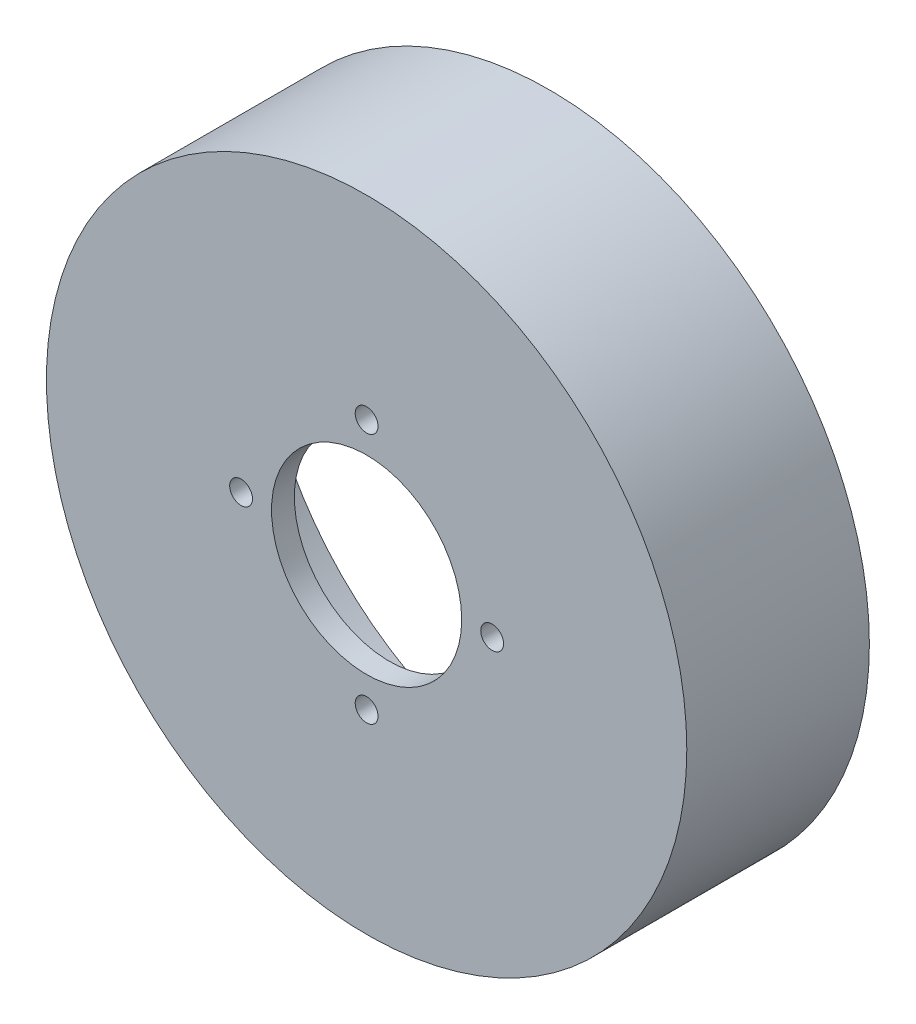
ISO-10303-21;
HEADER;
FILE_DESCRIPTION(('STEP AP214'),'2;1');
FILE_NAME('part.step','',(''),(''),'','','');
FILE_SCHEMA(('AUTOMOTIVE_DESIGN { 1 0 10303 214 1 1 1 1 }'));
ENDSEC;
DATA;
#1=APPLICATION_CONTEXT('core data for automotive mechanical design processes');
#2=APPLICATION_PROTOCOL_DEFINITION('international standard','automotive_design',2000,#1);
#3=PRODUCT_CONTEXT('',#1,'mechanical');
#4=PRODUCT('Part','Part','',(#3));
#5=PRODUCT_RELATED_PRODUCT_CATEGORY('part','',(#4));
#6=PRODUCT_DEFINITION_FORMATION('','',#4);
#7=PRODUCT_DEFINITION_CONTEXT('part definition',#1,'design');
#8=PRODUCT_DEFINITION('design','',#6,#7);
#9=PRODUCT_DEFINITION_SHAPE('','',#8);
#10=(LENGTH_UNIT() NAMED_UNIT(*) SI_UNIT(.MILLI.,.METRE.));
#11=(NAMED_UNIT(*) PLANE_ANGLE_UNIT() SI_UNIT($,.RADIAN.));
#12=(NAMED_UNIT(*) SI_UNIT($,.STERADIAN.) SOLID_ANGLE_UNIT());
#13=UNCERTAINTY_MEASURE_WITH_UNIT(LENGTH_MEASURE(1.E-05),#10,'distance_accuracy_value','');
#14=(GEOMETRIC_REPRESENTATION_CONTEXT(3) GLOBAL_UNCERTAINTY_ASSIGNED_CONTEXT((#13)) GLOBAL_UNIT_ASSIGNED_CONTEXT((#10,
#11,#12)) REPRESENTATION_CONTEXT('',''));
#15=CARTESIAN_POINT('',(0.,0.,0.));
#16=DIRECTION('',(0.,0.,1.));
#17=DIRECTION('',(1.,0.,0.));
#18=AXIS2_PLACEMENT_3D('',#15,#16,#17);
#19=CARTESIAN_POINT('',(0.,0.,16.));
#20=DIRECTION('',(0.,0.,-1.));
#21=DIRECTION('',(-1.,0.,0.));
#22=AXIS2_PLACEMENT_3D('',#19,#20,#21);
#23=CYLINDRICAL_SURFACE('',#22,42.0875);
#24=CARTESIAN_POINT('',(0.,0.,16.));
#25=DIRECTION('',(0.,0.,1.));
#26=DIRECTION('',(1.,0.,0.));
#27=AXIS2_PLACEMENT_3D('',#24,#25,#26);
#28=CIRCLE('',#27,42.0875);
#29=CARTESIAN_POINT('',(42.0875,0.,16.));
#30=VERTEX_POINT('',#29);
#31=EDGE_CURVE('E11',#30,#30,#28,.T.);
#32=ORIENTED_EDGE('',*,*,#31,.F.);
#33=EDGE_LOOP('',(#32));
#34=FACE_BOUND('',#33,.T.);
#35=CARTESIAN_POINT('',(0.,0.,-8.00000000000001));
#36=DIRECTION('',(0.,0.,1.));
#37=DIRECTION('',(1.,0.,0.));
#38=AXIS2_PLACEMENT_3D('',#35,#36,#37);
#39=CIRCLE('',#38,42.0875);
#40=CARTESIAN_POINT('',(42.0875,0.,-8.00000000000001));
#41=VERTEX_POINT('',#40);
#42=EDGE_CURVE('E40',#41,#41,#39,.T.);
#43=ORIENTED_EDGE('',*,*,#42,.T.);
#44=EDGE_LOOP('',(#43));
#45=FACE_BOUND('',#44,.T.);
#46=ADVANCED_FACE('F33',(#34,#45),#23,.T.);
#47=CARTESIAN_POINT('',(0.,0.,16.));
#48=DIRECTION('',(0.,0.,1.));
#49=DIRECTION('',(1.,0.,0.));
#50=AXIS2_PLACEMENT_3D('',#47,#48,#49);
#51=PLANE('',#50);
#52=CARTESIAN_POINT('',(-16.5,0.,16.));
#53=DIRECTION('',(0.,0.,-1.));
#54=DIRECTION('',(1.,0.,0.));
#55=AXIS2_PLACEMENT_3D('',#52,#53,#54);
#56=CIRCLE('',#55,1.5);
#57=CARTESIAN_POINT('',(-15.,0.,16.));
#58=VERTEX_POINT('',#57);
#59=EDGE_CURVE('E63',#58,#58,#56,.T.);
#60=ORIENTED_EDGE('',*,*,#59,.T.);
#61=EDGE_LOOP('',(#60));
#62=FACE_BOUND('',#61,.T.);
#63=CARTESIAN_POINT('',(1.72828326272735E-13,16.5,16.));
#64=DIRECTION('',(0.,0.,-1.));
#65=DIRECTION('',(0.,-1.,0.));
#66=AXIS2_PLACEMENT_3D('',#63,#64,#65);
#67=CIRCLE('',#66,1.5);
#68=CARTESIAN_POINT('',(1.57116660247941E-13,15.,16.));
#69=VERTEX_POINT('',#68);
#70=EDGE_CURVE('E68',#69,#69,#67,.T.);
#71=ORIENTED_EDGE('',*,*,#70,.T.);
#72=EDGE_LOOP('',(#71));
#73=FACE_BOUND('',#72,.T.);
#74=CARTESIAN_POINT('',(0.,-16.5,16.));
#75=DIRECTION('',(0.,0.,-1.));
#76=DIRECTION('',(0.,1.,0.));
#77=AXIS2_PLACEMENT_3D('',#74,#75,#76);
#78=CIRCLE('',#77,1.5);
#79=CARTESIAN_POINT('',(0.,-15.,16.));
#80=VERTEX_POINT('',#79);
#81=EDGE_CURVE('E60',#80,#80,#78,.T.);
#82=ORIENTED_EDGE('',*,*,#81,.T.);
#83=EDGE_LOOP('',(#82));
#84=FACE_BOUND('',#83,.T.);
#85=CARTESIAN_POINT('',(16.5,0.,16.));
#86=DIRECTION('',(0.,0.,-1.));
#87=DIRECTION('',(-1.,0.,0.));
#88=AXIS2_PLACEMENT_3D('',#85,#86,#87);
#89=CIRCLE('',#88,1.5);
#90=CARTESIAN_POINT('',(15.,0.,16.));
#91=VERTEX_POINT('',#90);
#92=EDGE_CURVE('E57',#91,#91,#89,.T.);
#93=ORIENTED_EDGE('',*,*,#92,.T.);
#94=EDGE_LOOP('',(#93));
#95=FACE_BOUND('',#94,.T.);
#96=CARTESIAN_POINT('',(0.,0.,16.));
#97=DIRECTION('',(0.,0.,1.));
#98=DIRECTION('',(1.,0.,0.));
#99=AXIS2_PLACEMENT_3D('',#96,#97,#98);
#100=CIRCLE('',#99,12.5);
#101=CARTESIAN_POINT('',(12.5,0.,16.));
#102=VERTEX_POINT('',#101);
#103=EDGE_CURVE('E53',#102,#102,#100,.T.);
#104=ORIENTED_EDGE('',*,*,#103,.F.);
#105=EDGE_LOOP('',(#104));
#106=FACE_BOUND('',#105,.T.);
#107=ORIENTED_EDGE('',*,*,#31,.T.);
#108=EDGE_LOOP('',(#107));
#109=FACE_BOUND('',#108,.T.);
#110=ADVANCED_FACE('F110',(#62,#73,#84,#95,#106,#109),#51,.T.);
#111=CARTESIAN_POINT('',(0.,0.,-8.00000000000001));
#112=DIRECTION('',(0.,0.,1.));
#113=DIRECTION('',(1.,0.,0.));
#114=AXIS2_PLACEMENT_3D('',#111,#112,#113);
#115=PLANE('',#114);
#116=CARTESIAN_POINT('',(0.,0.,-8.00000000000001));
#117=DIRECTION('',(0.,0.,-1.));
#118=DIRECTION('',(-1.,0.,0.));
#119=AXIS2_PLACEMENT_3D('',#116,#117,#118);
#120=CIRCLE('',#119,38.2875);
#121=CARTESIAN_POINT('',(-38.2875,0.,-8.00000000000001));
#122=VERTEX_POINT('',#121);
#123=EDGE_CURVE('E86',#122,#122,#120,.T.);
#124=ORIENTED_EDGE('',*,*,#123,.F.);
#125=EDGE_LOOP('',(#124));
#126=FACE_BOUND('',#125,.T.);
#127=ORIENTED_EDGE('',*,*,#42,.F.);
#128=EDGE_LOOP('',(#127));
#129=FACE_BOUND('',#128,.T.);
#130=ADVANCED_FACE('F106',(#126,#129),#115,.F.);
#131=CARTESIAN_POINT('',(0.,0.,2.99999999999999));
#132=DIRECTION('',(0.,0.,1.));
#133=DIRECTION('',(1.,0.,0.));
#134=AXIS2_PLACEMENT_3D('',#131,#132,#133);
#135=PLANE('',#134);
#136=CARTESIAN_POINT('',(0.,0.,2.99999999999999));
#137=DIRECTION('',(0.,0.,-1.));
#138=DIRECTION('',(-1.,0.,0.));
#139=AXIS2_PLACEMENT_3D('',#136,#137,#138);
#140=CIRCLE('',#139,34.2875);
#141=CARTESIAN_POINT('',(-34.2875,0.,2.99999999999999));
#142=VERTEX_POINT('',#141);
#143=EDGE_CURVE('E81',#142,#142,#140,.T.);
#144=ORIENTED_EDGE('',*,*,#143,.F.);
#145=EDGE_LOOP('',(#144));
#146=FACE_BOUND('',#145,.T.);
#147=CARTESIAN_POINT('',(0.,0.,2.99999999999999));
#148=DIRECTION('',(0.,0.,1.));
#149=DIRECTION('',(1.,0.,0.));
#150=AXIS2_PLACEMENT_3D('',#147,#148,#149);
#151=CIRCLE('',#150,38.2875);
#152=CARTESIAN_POINT('',(38.2875,0.,2.99999999999999));
#153=VERTEX_POINT('',#152);
#154=EDGE_CURVE('E45',#153,#153,#151,.F.);
#155=ORIENTED_EDGE('',*,*,#154,.T.);
#156=EDGE_LOOP('',(#155));
#157=FACE_BOUND('',#156,.T.);
#158=ADVANCED_FACE('F93',(#146,#157),#135,.F.);
#159=CARTESIAN_POINT('',(0.,0.,124.29340353872));
#160=DIRECTION('',(0.,0.,-1.));
#161=DIRECTION('',(-1.,0.,0.));
#162=AXIS2_PLACEMENT_3D('',#159,#160,#161);
#163=CYLINDRICAL_SURFACE('',#162,38.2875);
#164=ORIENTED_EDGE('',*,*,#123,.T.);
#165=EDGE_LOOP('',(#164));
#166=FACE_BOUND('',#165,.T.);
#167=ORIENTED_EDGE('',*,*,#154,.F.);
#168=EDGE_LOOP('',(#167));
#169=FACE_BOUND('',#168,.T.);
#170=ADVANCED_FACE('F95',(#166,#169),#163,.F.);
#171=CARTESIAN_POINT('',(0.,0.,13.));
#172=DIRECTION('',(0.,0.,1.));
#173=DIRECTION('',(1.,0.,0.));
#174=AXIS2_PLACEMENT_3D('',#171,#172,#173);
#175=PLANE('',#174);
#176=CARTESIAN_POINT('',(-16.5,0.,13.));
#177=DIRECTION('',(0.,0.,1.));
#178=DIRECTION('',(1.,0.,0.));
#179=AXIS2_PLACEMENT_3D('',#176,#177,#178);
#180=CIRCLE('',#179,1.5);
#181=CARTESIAN_POINT('',(-15.,0.,13.));
#182=VERTEX_POINT('',#181);
#183=EDGE_CURVE('E36',#182,#182,#180,.T.);
#184=ORIENTED_EDGE('',*,*,#183,.T.);
#185=EDGE_LOOP('',(#184));
#186=FACE_BOUND('',#185,.T.);
#187=CARTESIAN_POINT('',(1.72828326272735E-13,16.5,13.));
#188=DIRECTION('',(0.,0.,1.));
#189=DIRECTION('',(1.,0.,0.));
#190=AXIS2_PLACEMENT_3D('',#187,#188,#189);
#191=CIRCLE('',#190,1.5);
#192=CARTESIAN_POINT('',(1.50000000000017,16.5,13.));
#193=VERTEX_POINT('',#192);
#194=EDGE_CURVE('E61',#193,#193,#191,.T.);
#195=ORIENTED_EDGE('',*,*,#194,.T.);
#196=EDGE_LOOP('',(#195));
#197=FACE_BOUND('',#196,.T.);
#198=CARTESIAN_POINT('',(0.,-16.5,13.));
#199=DIRECTION('',(0.,0.,1.));
#200=DIRECTION('',(1.,0.,0.));
#201=AXIS2_PLACEMENT_3D('',#198,#199,#200);
#202=CIRCLE('',#201,1.5);
#203=CARTESIAN_POINT('',(1.49999999999994,-16.5,13.));
#204=VERTEX_POINT('',#203);
#205=EDGE_CURVE('E58',#204,#204,#202,.T.);
#206=ORIENTED_EDGE('',*,*,#205,.T.);
#207=EDGE_LOOP('',(#206));
#208=FACE_BOUND('',#207,.T.);
#209=CARTESIAN_POINT('',(16.5,0.,13.));
#210=DIRECTION('',(0.,0.,1.));
#211=DIRECTION('',(1.,0.,0.));
#212=AXIS2_PLACEMENT_3D('',#209,#210,#211);
#213=CIRCLE('',#212,1.5);
#214=CARTESIAN_POINT('',(18.,0.,13.));
#215=VERTEX_POINT('',#214);
#216=EDGE_CURVE('E54',#215,#215,#213,.T.);
#217=ORIENTED_EDGE('',*,*,#216,.T.);
#218=EDGE_LOOP('',(#217));
#219=FACE_BOUND('',#218,.T.);
#220=CARTESIAN_POINT('',(0.,0.,13.));
#221=DIRECTION('',(0.,0.,1.));
#222=DIRECTION('',(1.,0.,0.));
#223=AXIS2_PLACEMENT_3D('',#220,#221,#222);
#224=CIRCLE('',#223,12.5);
#225=CARTESIAN_POINT('',(12.5,0.,13.));
#226=VERTEX_POINT('',#225);
#227=EDGE_CURVE('E50',#226,#226,#224,.T.);
#228=ORIENTED_EDGE('',*,*,#227,.T.);
#229=EDGE_LOOP('',(#228));
#230=FACE_BOUND('',#229,.T.);
#231=CARTESIAN_POINT('',(0.,0.,13.));
#232=DIRECTION('',(0.,0.,1.));
#233=DIRECTION('',(1.,0.,0.));
#234=AXIS2_PLACEMENT_3D('',#231,#232,#233);
#235=CIRCLE('',#234,34.2875);
#236=CARTESIAN_POINT('',(34.2875,0.,13.));
#237=VERTEX_POINT('',#236);
#238=EDGE_CURVE('E84',#237,#237,#235,.F.);
#239=ORIENTED_EDGE('',*,*,#238,.T.);
#240=EDGE_LOOP('',(#239));
#241=FACE_BOUND('',#240,.T.);
#242=ADVANCED_FACE('F97',(#186,#197,#208,#219,#230,#241),#175,.F.);
#243=CARTESIAN_POINT('',(0.,0.,112.979695039735));
#244=DIRECTION('',(0.,0.,-1.));
#245=DIRECTION('',(-1.,0.,0.));
#246=AXIS2_PLACEMENT_3D('',#243,#244,#245);
#247=CYLINDRICAL_SURFACE('',#246,34.2875);
#248=ORIENTED_EDGE('',*,*,#143,.T.);
#249=EDGE_LOOP('',(#248));
#250=FACE_BOUND('',#249,.T.);
#251=ORIENTED_EDGE('',*,*,#238,.F.);
#252=EDGE_LOOP('',(#251));
#253=FACE_BOUND('',#252,.T.);
#254=ADVANCED_FACE('F103',(#250,#253),#247,.F.);
#255=CARTESIAN_POINT('',(0.,0.,-8.00000000000001));
#256=DIRECTION('',(0.,0.,1.));
#257=DIRECTION('',(1.,0.,0.));
#258=AXIS2_PLACEMENT_3D('',#255,#256,#257);
#259=CYLINDRICAL_SURFACE('',#258,12.5);
#260=ORIENTED_EDGE('',*,*,#103,.T.);
#261=EDGE_LOOP('',(#260));
#262=FACE_BOUND('',#261,.T.);
#263=ORIENTED_EDGE('',*,*,#227,.F.);
#264=EDGE_LOOP('',(#263));
#265=FACE_BOUND('',#264,.T.);
#266=ADVANCED_FACE('F140',(#262,#265),#259,.F.);
#267=CARTESIAN_POINT('',(16.5,0.,16.));
#268=DIRECTION('',(0.,0.,-1.));
#269=DIRECTION('',(-1.,0.,0.));
#270=AXIS2_PLACEMENT_3D('',#267,#268,#269);
#271=CYLINDRICAL_SURFACE('',#270,1.5);
#272=ORIENTED_EDGE('',*,*,#92,.F.);
#273=EDGE_LOOP('',(#272));
#274=FACE_BOUND('',#273,.T.);
#275=ORIENTED_EDGE('',*,*,#216,.F.);
#276=EDGE_LOOP('',(#275));
#277=FACE_BOUND('',#276,.T.);
#278=ADVANCED_FACE('F151',(#274,#277),#271,.F.);
#279=CARTESIAN_POINT('',(0.,-16.5,16.));
#280=DIRECTION('',(0.,0.,-1.));
#281=DIRECTION('',(-1.,0.,0.));
#282=AXIS2_PLACEMENT_3D('',#279,#280,#281);
#283=CYLINDRICAL_SURFACE('',#282,1.5);
#284=ORIENTED_EDGE('',*,*,#81,.F.);
#285=EDGE_LOOP('',(#284));
#286=FACE_BOUND('',#285,.T.);
#287=ORIENTED_EDGE('',*,*,#205,.F.);
#288=EDGE_LOOP('',(#287));
#289=FACE_BOUND('',#288,.T.);
#290=ADVANCED_FACE('F160',(#286,#289),#283,.F.);
#291=CARTESIAN_POINT('',(1.72828326272735E-13,16.5,16.));
#292=DIRECTION('',(0.,0.,-1.));
#293=DIRECTION('',(-1.,0.,0.));
#294=AXIS2_PLACEMENT_3D('',#291,#292,#293);
#295=CYLINDRICAL_SURFACE('',#294,1.5);
#296=ORIENTED_EDGE('',*,*,#70,.F.);
#297=EDGE_LOOP('',(#296));
#298=FACE_BOUND('',#297,.T.);
#299=ORIENTED_EDGE('',*,*,#194,.F.);
#300=EDGE_LOOP('',(#299));
#301=FACE_BOUND('',#300,.T.);
#302=ADVANCED_FACE('F181',(#298,#301),#295,.F.);
#303=CARTESIAN_POINT('',(-16.5,0.,16.));
#304=DIRECTION('',(0.,0.,-1.));
#305=DIRECTION('',(-1.,0.,0.));
#306=AXIS2_PLACEMENT_3D('',#303,#304,#305);
#307=CYLINDRICAL_SURFACE('',#306,1.5);
#308=ORIENTED_EDGE('',*,*,#59,.F.);
#309=EDGE_LOOP('',(#308));
#310=FACE_BOUND('',#309,.T.);
#311=ORIENTED_EDGE('',*,*,#183,.F.);
#312=EDGE_LOOP('',(#311));
#313=FACE_BOUND('',#312,.T.);
#314=ADVANCED_FACE('F191',(#310,#313),#307,.F.);
#315=CLOSED_SHELL('',(#46,#110,#130,#158,#170,#242,#254,#266,#278,#290,#302,#314));
#316=MANIFOLD_SOLID_BREP('B2',#315);
#317=ADVANCED_BREP_SHAPE_REPRESENTATION('',(#18,#316),#14);
#318=SHAPE_DEFINITION_REPRESENTATION(#9,#317);
ENDSEC;
END-ISO-10303-21;
